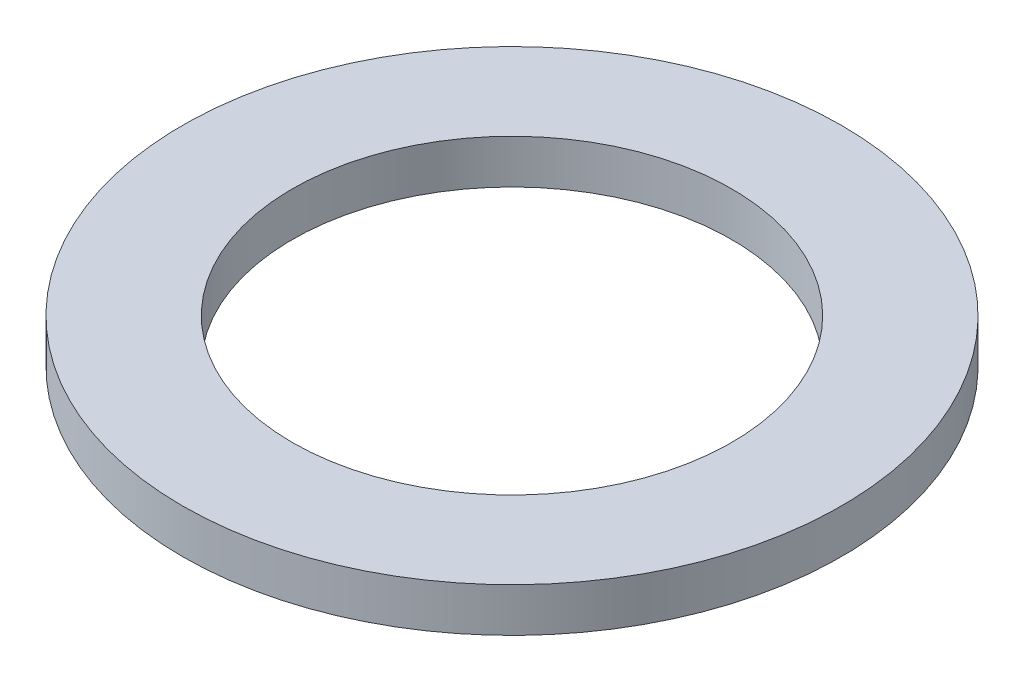
ISO-10303-21;
HEADER;
FILE_DESCRIPTION(('STEP AP214'),'2;1');
FILE_NAME('part.step','',(''),(''),'','','');
FILE_SCHEMA(('AUTOMOTIVE_DESIGN { 1 0 10303 214 1 1 1 1 }'));
ENDSEC;
DATA;
#1=APPLICATION_CONTEXT('core data for automotive mechanical design processes');
#2=APPLICATION_PROTOCOL_DEFINITION('international standard','automotive_design',2000,#1);
#3=PRODUCT_CONTEXT('',#1,'mechanical');
#4=PRODUCT('Part','Part','',(#3));
#5=PRODUCT_RELATED_PRODUCT_CATEGORY('part','',(#4));
#6=PRODUCT_DEFINITION_FORMATION('','',#4);
#7=PRODUCT_DEFINITION_CONTEXT('part definition',#1,'design');
#8=PRODUCT_DEFINITION('design','',#6,#7);
#9=PRODUCT_DEFINITION_SHAPE('','',#8);
#10=(LENGTH_UNIT() NAMED_UNIT(*) SI_UNIT(.MILLI.,.METRE.));
#11=(NAMED_UNIT(*) PLANE_ANGLE_UNIT() SI_UNIT($,.RADIAN.));
#12=(NAMED_UNIT(*) SI_UNIT($,.STERADIAN.) SOLID_ANGLE_UNIT());
#13=UNCERTAINTY_MEASURE_WITH_UNIT(LENGTH_MEASURE(1.E-05),#10,'distance_accuracy_value','');
#14=(GEOMETRIC_REPRESENTATION_CONTEXT(3) GLOBAL_UNCERTAINTY_ASSIGNED_CONTEXT((#13)) GLOBAL_UNIT_ASSIGNED_CONTEXT((#10,
#11,#12)) REPRESENTATION_CONTEXT('',''));
#15=CARTESIAN_POINT('',(0.,0.,0.));
#16=DIRECTION('',(0.,0.,1.));
#17=DIRECTION('',(1.,0.,0.));
#18=AXIS2_PLACEMENT_3D('',#15,#16,#17);
#19=CARTESIAN_POINT('',(0.,7.,0.));
#20=DIRECTION('',(0.,-1.,0.));
#21=DIRECTION('',(0.,0.,-1.));
#22=AXIS2_PLACEMENT_3D('',#19,#20,#21);
#23=CYLINDRICAL_SURFACE('',#22,52.5);
#24=CARTESIAN_POINT('',(0.,7.,0.));
#25=DIRECTION('',(0.,1.,0.));
#26=DIRECTION('',(0.,0.,1.));
#27=AXIS2_PLACEMENT_3D('',#24,#25,#26);
#28=CIRCLE('',#27,52.5);
#29=CARTESIAN_POINT('',(0.,7.,52.5));
#30=VERTEX_POINT('',#29);
#31=EDGE_CURVE('E10',#30,#30,#28,.T.);
#32=ORIENTED_EDGE('',*,*,#31,.F.);
#33=EDGE_LOOP('',(#32));
#34=FACE_BOUND('',#33,.T.);
#35=CARTESIAN_POINT('',(0.,0.,0.));
#36=DIRECTION('',(0.,1.,0.));
#37=DIRECTION('',(0.,0.,1.));
#38=AXIS2_PLACEMENT_3D('',#35,#36,#37);
#39=CIRCLE('',#38,52.5);
#40=CARTESIAN_POINT('',(0.,0.,52.5));
#41=VERTEX_POINT('',#40);
#42=EDGE_CURVE('E37',#41,#41,#39,.T.);
#43=ORIENTED_EDGE('',*,*,#42,.T.);
#44=EDGE_LOOP('',(#43));
#45=FACE_BOUND('',#44,.T.);
#46=ADVANCED_FACE('F40',(#34,#45),#23,.T.);
#47=CARTESIAN_POINT('',(0.,7.,0.));
#48=DIRECTION('',(0.,1.,0.));
#49=DIRECTION('',(0.,0.,1.));
#50=AXIS2_PLACEMENT_3D('',#47,#48,#49);
#51=PLANE('',#50);
#52=CARTESIAN_POINT('',(0.,7.,0.));
#53=DIRECTION('',(0.,1.,0.));
#54=DIRECTION('',(0.,0.,1.));
#55=AXIS2_PLACEMENT_3D('',#52,#53,#54);
#56=CIRCLE('',#55,35.);
#57=CARTESIAN_POINT('',(0.,7.,35.));
#58=VERTEX_POINT('',#57);
#59=EDGE_CURVE('E50',#58,#58,#56,.T.);
#60=ORIENTED_EDGE('',*,*,#59,.F.);
#61=EDGE_LOOP('',(#60));
#62=FACE_BOUND('',#61,.T.);
#63=ORIENTED_EDGE('',*,*,#31,.T.);
#64=EDGE_LOOP('',(#63));
#65=FACE_BOUND('',#64,.T.);
#66=ADVANCED_FACE('F59',(#62,#65),#51,.T.);
#67=CARTESIAN_POINT('',(0.,0.,0.));
#68=DIRECTION('',(0.,1.,0.));
#69=DIRECTION('',(0.,0.,1.));
#70=AXIS2_PLACEMENT_3D('',#67,#68,#69);
#71=PLANE('',#70);
#72=CARTESIAN_POINT('',(0.,0.,0.));
#73=DIRECTION('',(0.,1.,0.));
#74=DIRECTION('',(0.,0.,1.));
#75=AXIS2_PLACEMENT_3D('',#72,#73,#74);
#76=CIRCLE('',#75,35.);
#77=CARTESIAN_POINT('',(0.,0.,35.));
#78=VERTEX_POINT('',#77);
#79=EDGE_CURVE('E47',#78,#78,#76,.T.);
#80=ORIENTED_EDGE('',*,*,#79,.T.);
#81=EDGE_LOOP('',(#80));
#82=FACE_BOUND('',#81,.T.);
#83=ORIENTED_EDGE('',*,*,#42,.F.);
#84=EDGE_LOOP('',(#83));
#85=FACE_BOUND('',#84,.T.);
#86=ADVANCED_FACE('F58',(#82,#85),#71,.F.);
#87=CARTESIAN_POINT('',(0.,7.,0.));
#88=DIRECTION('',(0.,-1.,0.));
#89=DIRECTION('',(0.,0.,-1.));
#90=AXIS2_PLACEMENT_3D('',#87,#88,#89);
#91=CYLINDRICAL_SURFACE('',#90,35.);
#92=ORIENTED_EDGE('',*,*,#59,.T.);
#93=EDGE_LOOP('',(#92));
#94=FACE_BOUND('',#93,.T.);
#95=ORIENTED_EDGE('',*,*,#79,.F.);
#96=EDGE_LOOP('',(#95));
#97=FACE_BOUND('',#96,.T.);
#98=ADVANCED_FACE('F54',(#94,#97),#91,.F.);
#99=CLOSED_SHELL('',(#46,#66,#86,#98));
#100=MANIFOLD_SOLID_BREP('B2',#99);
#101=ADVANCED_BREP_SHAPE_REPRESENTATION('',(#18,#100),#14);
#102=SHAPE_DEFINITION_REPRESENTATION(#9,#101);
ENDSEC;
END-ISO-10303-21;
